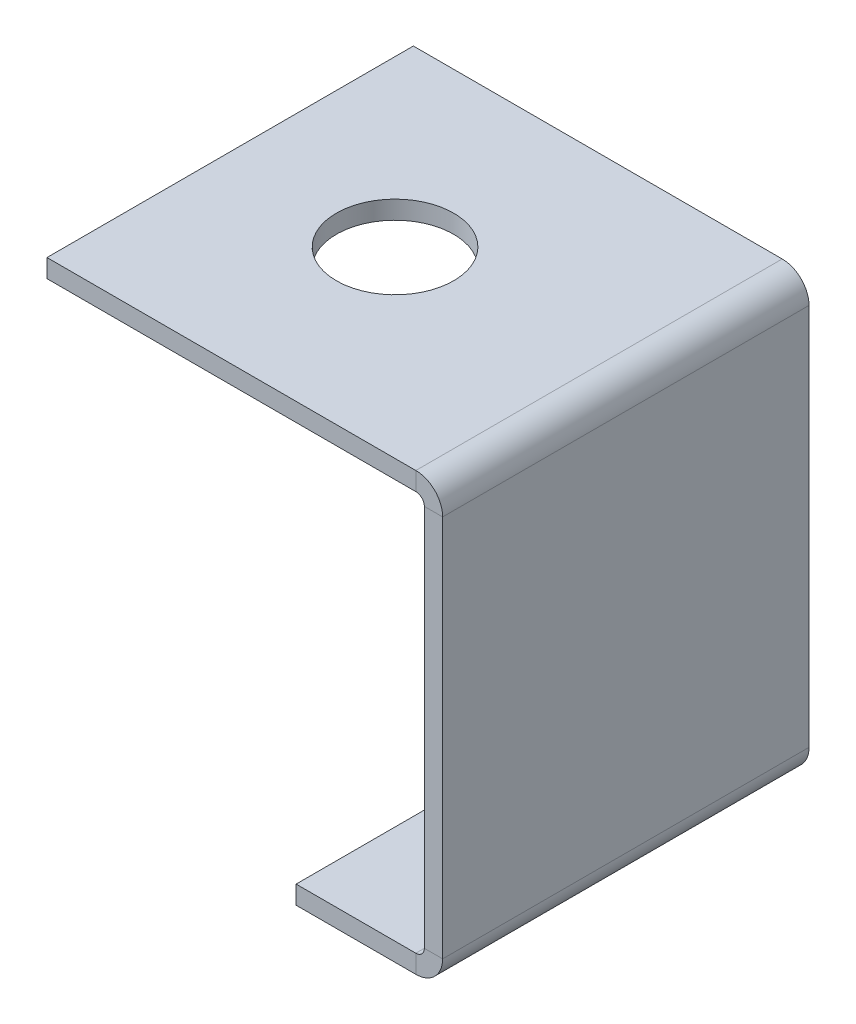
ISO-10303-21;
HEADER;
FILE_DESCRIPTION(('STEP AP214'),'2;1');
FILE_NAME('part.step','',(''),(''),'','','');
FILE_SCHEMA(('AUTOMOTIVE_DESIGN { 1 0 10303 214 1 1 1 1 }'));
ENDSEC;
DATA;
#1=APPLICATION_CONTEXT('core data for automotive mechanical design processes');
#2=APPLICATION_PROTOCOL_DEFINITION('international standard','automotive_design',2000,#1);
#3=PRODUCT_CONTEXT('',#1,'mechanical');
#4=PRODUCT('Part','Part','',(#3));
#5=PRODUCT_RELATED_PRODUCT_CATEGORY('part','',(#4));
#6=PRODUCT_DEFINITION_FORMATION('','',#4);
#7=PRODUCT_DEFINITION_CONTEXT('part definition',#1,'design');
#8=PRODUCT_DEFINITION('design','',#6,#7);
#9=PRODUCT_DEFINITION_SHAPE('','',#8);
#10=(LENGTH_UNIT() NAMED_UNIT(*) SI_UNIT(.MILLI.,.METRE.));
#11=(NAMED_UNIT(*) PLANE_ANGLE_UNIT() SI_UNIT($,.RADIAN.));
#12=(NAMED_UNIT(*) SI_UNIT($,.STERADIAN.) SOLID_ANGLE_UNIT());
#13=UNCERTAINTY_MEASURE_WITH_UNIT(LENGTH_MEASURE(1.E-05),#10,'distance_accuracy_value','');
#14=(GEOMETRIC_REPRESENTATION_CONTEXT(3) GLOBAL_UNCERTAINTY_ASSIGNED_CONTEXT((#13)) GLOBAL_UNIT_ASSIGNED_CONTEXT((#10,
#11,#12)) REPRESENTATION_CONTEXT('',''));
#15=CARTESIAN_POINT('',(0.,0.,0.));
#16=DIRECTION('',(0.,0.,1.));
#17=DIRECTION('',(1.,0.,0.));
#18=AXIS2_PLACEMENT_3D('',#15,#16,#17);
#19=CARTESIAN_POINT('',(34.2900000000001,-37.81552,31.75));
#20=DIRECTION('',(0.,0.,-1.));
#21=DIRECTION('',(0.,1.,0.));
#22=AXIS2_PLACEMENT_3D('',#19,#20,#21);
#23=PLANE('',#22);
#24=DIRECTION('',(1.,0.,0.));
#25=VECTOR('',#24,1.);
#26=CARTESIAN_POINT('',(32.7025000000001,-35.49142,31.75));
#27=LINE('',#26,#25);
#28=CARTESIAN_POINT('',(32.7025000000001,-35.49142,31.75));
#29=VERTEX_POINT('',#28);
#30=CARTESIAN_POINT('',(34.2900000000001,-35.49142,31.75));
#31=VERTEX_POINT('',#30);
#32=EDGE_CURVE('E199',#29,#31,#27,.T.);
#33=ORIENTED_EDGE('',*,*,#32,.T.);
#34=DIRECTION('',(0.,-1.,0.));
#35=VECTOR('',#34,1.);
#36=CARTESIAN_POINT('',(34.2900000000001,-37.81552,31.75));
#37=LINE('',#36,#35);
#38=CARTESIAN_POINT('',(34.29,-2.32409999999999,31.75));
#39=VERTEX_POINT('',#38);
#40=EDGE_CURVE('E225',#39,#31,#37,.T.);
#41=ORIENTED_EDGE('',*,*,#40,.F.);
#42=DIRECTION('',(1.,0.,0.));
#43=VECTOR('',#42,1.);
#44=CARTESIAN_POINT('',(32.7025,-2.3241,31.75));
#45=LINE('',#44,#43);
#46=CARTESIAN_POINT('',(32.7025,-2.3241,31.75));
#47=VERTEX_POINT('',#46);
#48=EDGE_CURVE('E217',#47,#39,#45,.T.);
#49=ORIENTED_EDGE('',*,*,#48,.F.);
#50=DIRECTION('',(0.,-1.,0.));
#51=VECTOR('',#50,1.);
#52=CARTESIAN_POINT('',(32.7025000000001,-37.81552,31.75));
#53=LINE('',#52,#51);
#54=EDGE_CURVE('E224',#47,#29,#53,.T.);
#55=ORIENTED_EDGE('',*,*,#54,.T.);
#56=EDGE_LOOP('',(#33,#41,#49,#55));
#57=FACE_BOUND('',#56,.T.);
#58=ADVANCED_FACE('F59',(#57),#23,.F.);
#59=CARTESIAN_POINT('',(34.29,-1.58749999999999,0.));
#60=DIRECTION('',(0.,0.,1.));
#61=DIRECTION('',(0.,-1.,0.));
#62=AXIS2_PLACEMENT_3D('',#59,#60,#61);
#63=PLANE('',#62);
#64=DIRECTION('',(1.,0.,0.));
#65=VECTOR('',#64,1.);
#66=CARTESIAN_POINT('',(32.7025000000001,-35.49142,0.));
#67=LINE('',#66,#65);
#68=CARTESIAN_POINT('',(32.7025000000001,-35.49142,0.));
#69=VERTEX_POINT('',#68);
#70=CARTESIAN_POINT('',(34.2900000000001,-35.49142,0.));
#71=VERTEX_POINT('',#70);
#72=EDGE_CURVE('E209',#69,#71,#67,.T.);
#73=ORIENTED_EDGE('',*,*,#72,.F.);
#74=DIRECTION('',(0.,1.,0.));
#75=VECTOR('',#74,1.);
#76=CARTESIAN_POINT('',(32.7025,-1.5875,0.));
#77=LINE('',#76,#75);
#78=CARTESIAN_POINT('',(32.7025,-2.3241,0.));
#79=VERTEX_POINT('',#78);
#80=EDGE_CURVE('E228',#69,#79,#77,.T.);
#81=ORIENTED_EDGE('',*,*,#80,.T.);
#82=DIRECTION('',(1.,0.,0.));
#83=VECTOR('',#82,1.);
#84=CARTESIAN_POINT('',(32.7025,-2.3241,0.));
#85=LINE('',#84,#83);
#86=CARTESIAN_POINT('',(34.29,-2.32409999999999,0.));
#87=VERTEX_POINT('',#86);
#88=EDGE_CURVE('E212',#79,#87,#85,.T.);
#89=ORIENTED_EDGE('',*,*,#88,.T.);
#90=DIRECTION('',(0.,1.,0.));
#91=VECTOR('',#90,1.);
#92=CARTESIAN_POINT('',(34.29,-1.58749999999999,0.));
#93=LINE('',#92,#91);
#94=EDGE_CURVE('E227',#71,#87,#93,.T.);
#95=ORIENTED_EDGE('',*,*,#94,.F.);
#96=EDGE_LOOP('',(#73,#81,#89,#95));
#97=FACE_BOUND('',#96,.T.);
#98=ADVANCED_FACE('F311',(#97),#63,.F.);
#99=CARTESIAN_POINT('',(34.29,1.18288198281482E-13,0.));
#100=DIRECTION('',(-1.,0.,0.));
#101=DIRECTION('',(0.,-1.,0.));
#102=AXIS2_PLACEMENT_3D('',#99,#100,#101);
#103=PLANE('',#102);
#104=DIRECTION('',(0.,0.,1.));
#105=VECTOR('',#104,1.);
#106=CARTESIAN_POINT('',(34.2900000000001,-35.49142,31.75));
#107=LINE('',#106,#105);
#108=EDGE_CURVE('E193',#31,#71,#107,.F.);
#109=ORIENTED_EDGE('',*,*,#108,.T.);
#110=ORIENTED_EDGE('',*,*,#94,.T.);
#111=DIRECTION('',(0.,0.,-1.));
#112=VECTOR('',#111,1.);
#113=CARTESIAN_POINT('',(34.29,-2.32409999999999,0.));
#114=LINE('',#113,#112);
#115=EDGE_CURVE('E220',#39,#87,#114,.T.);
#116=ORIENTED_EDGE('',*,*,#115,.F.);
#117=ORIENTED_EDGE('',*,*,#40,.T.);
#118=EDGE_LOOP('',(#109,#110,#116,#117));
#119=FACE_BOUND('',#118,.T.);
#120=ADVANCED_FACE('F317',(#119),#103,.F.);
#121=CARTESIAN_POINT('',(32.7025,1.12745471656068E-13,0.));
#122=DIRECTION('',(-1.,0.,0.));
#123=DIRECTION('',(0.,-1.,0.));
#124=AXIS2_PLACEMENT_3D('',#121,#122,#123);
#125=PLANE('',#124);
#126=ORIENTED_EDGE('',*,*,#80,.F.);
#127=DIRECTION('',(0.,0.,1.));
#128=VECTOR('',#127,1.);
#129=CARTESIAN_POINT('',(32.7025000000001,-35.49142,31.75));
#130=LINE('',#129,#128);
#131=EDGE_CURVE('E74',#29,#69,#130,.F.);
#132=ORIENTED_EDGE('',*,*,#131,.F.);
#133=ORIENTED_EDGE('',*,*,#54,.F.);
#134=DIRECTION('',(0.,0.,1.));
#135=VECTOR('',#134,1.);
#136=CARTESIAN_POINT('',(32.7025,-2.3241,0.));
#137=LINE('',#136,#135);
#138=EDGE_CURVE('E215',#79,#47,#137,.T.);
#139=ORIENTED_EDGE('',*,*,#138,.F.);
#140=EDGE_LOOP('',(#126,#132,#133,#139));
#141=FACE_BOUND('',#140,.T.);
#142=ADVANCED_FACE('F308',(#141),#125,.T.);
#143=CARTESIAN_POINT('',(0.,-1.5875,31.75));
#144=DIRECTION('',(0.,0.,1.));
#145=DIRECTION('',(1.,0.,0.));
#146=AXIS2_PLACEMENT_3D('',#143,#144,#145);
#147=PLANE('',#146);
#148=DIRECTION('',(1.,0.,0.));
#149=VECTOR('',#148,1.);
#150=CARTESIAN_POINT('',(0.,-1.5875,31.75));
#151=LINE('',#150,#149);
#152=CARTESIAN_POINT('',(0.,-1.5875,31.75));
#153=VERTEX_POINT('',#152);
#154=CARTESIAN_POINT('',(31.9659,-1.58750000000001,31.75));
#155=VERTEX_POINT('',#154);
#156=EDGE_CURVE('E262',#153,#155,#151,.T.);
#157=ORIENTED_EDGE('',*,*,#156,.T.);
#158=DIRECTION('',(0.,1.,0.));
#159=VECTOR('',#158,1.);
#160=CARTESIAN_POINT('',(31.9659,-1.58750000000001,31.75));
#161=LINE('',#160,#159);
#162=CARTESIAN_POINT('',(31.9659,0.,31.75));
#163=VERTEX_POINT('',#162);
#164=EDGE_CURVE('E238',#155,#163,#161,.T.);
#165=ORIENTED_EDGE('',*,*,#164,.T.);
#166=DIRECTION('',(1.,0.,0.));
#167=VECTOR('',#166,1.);
#168=CARTESIAN_POINT('',(0.,0.,31.75));
#169=LINE('',#168,#167);
#170=CARTESIAN_POINT('',(0.,0.,31.75));
#171=VERTEX_POINT('',#170);
#172=EDGE_CURVE('E270',#171,#163,#169,.T.);
#173=ORIENTED_EDGE('',*,*,#172,.F.);
#174=DIRECTION('',(0.,1.,0.));
#175=VECTOR('',#174,1.);
#176=CARTESIAN_POINT('',(0.,-1.5875,31.75));
#177=LINE('',#176,#175);
#178=EDGE_CURVE('E63',#153,#171,#177,.T.);
#179=ORIENTED_EDGE('',*,*,#178,.F.);
#180=EDGE_LOOP('',(#157,#165,#173,#179));
#181=FACE_BOUND('',#180,.T.);
#182=ADVANCED_FACE('F287',(#181),#147,.T.);
#183=CARTESIAN_POINT('',(0.,-1.5875,0.));
#184=DIRECTION('',(0.,1.,0.));
#185=DIRECTION('',(0.,0.,1.));
#186=AXIS2_PLACEMENT_3D('',#183,#184,#185);
#187=PLANE('',#186);
#188=CARTESIAN_POINT('',(14.2875,-1.5875,15.875));
#189=DIRECTION('',(0.,1.,0.));
#190=DIRECTION('',(0.,0.,1.));
#191=AXIS2_PLACEMENT_3D('',#188,#189,#190);
#192=CIRCLE('',#191,5.08);
#193=CARTESIAN_POINT('',(14.2875,-1.5875,20.955));
#194=VERTEX_POINT('',#193);
#195=EDGE_CURVE('E253',#194,#194,#192,.T.);
#196=ORIENTED_EDGE('',*,*,#195,.T.);
#197=EDGE_LOOP('',(#196));
#198=FACE_BOUND('',#197,.T.);
#199=DIRECTION('',(0.,0.,1.));
#200=VECTOR('',#199,1.);
#201=CARTESIAN_POINT('',(31.9659,-1.58750000000001,31.75));
#202=LINE('',#201,#200);
#203=CARTESIAN_POINT('',(31.9659,-1.58750000000001,0.));
#204=VERTEX_POINT('',#203);
#205=EDGE_CURVE('E244',#155,#204,#202,.F.);
#206=ORIENTED_EDGE('',*,*,#205,.F.);
#207=ORIENTED_EDGE('',*,*,#156,.F.);
#208=DIRECTION('',(0.,0.,1.));
#209=VECTOR('',#208,1.);
#210=CARTESIAN_POINT('',(0.,-1.5875,0.));
#211=LINE('',#210,#209);
#212=CARTESIAN_POINT('',(0.,-1.5875,0.));
#213=VERTEX_POINT('',#212);
#214=EDGE_CURVE('E259',#213,#153,#211,.T.);
#215=ORIENTED_EDGE('',*,*,#214,.F.);
#216=DIRECTION('',(-1.,0.,0.));
#217=VECTOR('',#216,1.);
#218=CARTESIAN_POINT('',(0.,-1.5875,0.));
#219=LINE('',#218,#217);
#220=EDGE_CURVE('E266',#204,#213,#219,.T.);
#221=ORIENTED_EDGE('',*,*,#220,.F.);
#222=EDGE_LOOP('',(#206,#207,#215,#221));
#223=FACE_BOUND('',#222,.T.);
#224=ADVANCED_FACE('F298',(#198,#223),#187,.F.);
#225=CARTESIAN_POINT('',(0.,0.,0.));
#226=DIRECTION('',(0.,1.,0.));
#227=DIRECTION('',(0.,0.,1.));
#228=AXIS2_PLACEMENT_3D('',#225,#226,#227);
#229=PLANE('',#228);
#230=CARTESIAN_POINT('',(14.2875,0.,15.875));
#231=DIRECTION('',(0.,1.,0.));
#232=DIRECTION('',(0.,0.,1.));
#233=AXIS2_PLACEMENT_3D('',#230,#231,#232);
#234=CIRCLE('',#233,5.08);
#235=CARTESIAN_POINT('',(14.2875,0.,20.955));
#236=VERTEX_POINT('',#235);
#237=EDGE_CURVE('E250',#236,#236,#234,.T.);
#238=ORIENTED_EDGE('',*,*,#237,.F.);
#239=EDGE_LOOP('',(#238));
#240=FACE_BOUND('',#239,.T.);
#241=ORIENTED_EDGE('',*,*,#172,.T.);
#242=DIRECTION('',(0.,0.,1.));
#243=VECTOR('',#242,1.);
#244=CARTESIAN_POINT('',(31.9659,0.,31.75));
#245=LINE('',#244,#243);
#246=CARTESIAN_POINT('',(31.9659,0.,0.));
#247=VERTEX_POINT('',#246);
#248=EDGE_CURVE('E233',#163,#247,#245,.F.);
#249=ORIENTED_EDGE('',*,*,#248,.T.);
#250=DIRECTION('',(-1.,0.,0.));
#251=VECTOR('',#250,1.);
#252=CARTESIAN_POINT('',(0.,0.,0.));
#253=LINE('',#252,#251);
#254=CARTESIAN_POINT('',(0.,0.,0.));
#255=VERTEX_POINT('',#254);
#256=EDGE_CURVE('E263',#247,#255,#253,.T.);
#257=ORIENTED_EDGE('',*,*,#256,.T.);
#258=DIRECTION('',(0.,0.,1.));
#259=VECTOR('',#258,1.);
#260=CARTESIAN_POINT('',(0.,0.,0.));
#261=LINE('',#260,#259);
#262=EDGE_CURVE('E256',#255,#171,#261,.T.);
#263=ORIENTED_EDGE('',*,*,#262,.T.);
#264=EDGE_LOOP('',(#241,#249,#257,#263));
#265=FACE_BOUND('',#264,.T.);
#266=ADVANCED_FACE('F275',(#240,#265),#229,.T.);
#267=CARTESIAN_POINT('',(0.,-1.5875,0.));
#268=DIRECTION('',(-1.,0.,0.));
#269=DIRECTION('',(0.,0.,1.));
#270=AXIS2_PLACEMENT_3D('',#267,#268,#269);
#271=PLANE('',#270);
#272=ORIENTED_EDGE('',*,*,#262,.F.);
#273=DIRECTION('',(0.,1.,0.));
#274=VECTOR('',#273,1.);
#275=CARTESIAN_POINT('',(0.,-1.5875,0.));
#276=LINE('',#275,#274);
#277=EDGE_CURVE('E13',#213,#255,#276,.T.);
#278=ORIENTED_EDGE('',*,*,#277,.F.);
#279=ORIENTED_EDGE('',*,*,#214,.T.);
#280=ORIENTED_EDGE('',*,*,#178,.T.);
#281=EDGE_LOOP('',(#272,#278,#279,#280));
#282=FACE_BOUND('',#281,.T.);
#283=ADVANCED_FACE('F61',(#282),#271,.T.);
#284=CARTESIAN_POINT('',(0.,-1.5875,0.));
#285=DIRECTION('',(0.,0.,-1.));
#286=DIRECTION('',(-1.,0.,0.));
#287=AXIS2_PLACEMENT_3D('',#284,#285,#286);
#288=PLANE('',#287);
#289=DIRECTION('',(0.,1.,0.));
#290=VECTOR('',#289,1.);
#291=CARTESIAN_POINT('',(31.9659,-1.58750000000001,0.));
#292=LINE('',#291,#290);
#293=EDGE_CURVE('E248',#204,#247,#292,.T.);
#294=ORIENTED_EDGE('',*,*,#293,.F.);
#295=ORIENTED_EDGE('',*,*,#220,.T.);
#296=ORIENTED_EDGE('',*,*,#277,.T.);
#297=ORIENTED_EDGE('',*,*,#256,.F.);
#298=EDGE_LOOP('',(#294,#295,#296,#297));
#299=FACE_BOUND('',#298,.T.);
#300=ADVANCED_FACE('F280',(#299),#288,.T.);
#301=CARTESIAN_POINT('',(14.2875,-1.5875,15.875));
#302=DIRECTION('',(0.,1.,0.));
#303=DIRECTION('',(0.,0.,1.));
#304=AXIS2_PLACEMENT_3D('',#301,#302,#303);
#305=CYLINDRICAL_SURFACE('',#304,5.08);
#306=ORIENTED_EDGE('',*,*,#195,.F.);
#307=EDGE_LOOP('',(#306));
#308=FACE_BOUND('',#307,.T.);
#309=ORIENTED_EDGE('',*,*,#237,.T.);
#310=EDGE_LOOP('',(#309));
#311=FACE_BOUND('',#310,.T.);
#312=ADVANCED_FACE('F331',(#308,#311),#305,.F.);
#313=CARTESIAN_POINT('',(31.9659,-2.3241,0.));
#314=DIRECTION('',(0.,0.,-1.));
#315=DIRECTION('',(-1.,0.,0.));
#316=AXIS2_PLACEMENT_3D('',#313,#314,#315);
#317=PLANE('',#316);
#318=ORIENTED_EDGE('',*,*,#88,.F.);
#319=CARTESIAN_POINT('',(31.9659,-2.3241,0.));
#320=DIRECTION('',(0.,0.,1.));
#321=DIRECTION('',(1.,0.,0.));
#322=AXIS2_PLACEMENT_3D('',#319,#320,#321);
#323=CIRCLE('',#322,0.73659999999999);
#324=EDGE_CURVE('E241',#204,#79,#323,.F.);
#325=ORIENTED_EDGE('',*,*,#324,.F.);
#326=ORIENTED_EDGE('',*,*,#293,.T.);
#327=CARTESIAN_POINT('',(31.9659,-2.3241,0.));
#328=DIRECTION('',(0.,0.,1.));
#329=DIRECTION('',(1.,0.,0.));
#330=AXIS2_PLACEMENT_3D('',#327,#328,#329);
#331=CIRCLE('',#330,2.32409999999999);
#332=EDGE_CURVE('E82',#247,#87,#331,.F.);
#333=ORIENTED_EDGE('',*,*,#332,.T.);
#334=EDGE_LOOP('',(#318,#325,#326,#333));
#335=FACE_BOUND('',#334,.T.);
#336=ADVANCED_FACE('F328',(#335),#317,.T.);
#337=CARTESIAN_POINT('',(31.9659,-2.3241,31.75));
#338=DIRECTION('',(0.,0.,-1.));
#339=DIRECTION('',(-1.,0.,0.));
#340=AXIS2_PLACEMENT_3D('',#337,#338,#339);
#341=PLANE('',#340);
#342=CARTESIAN_POINT('',(31.9659,-2.3241,31.75));
#343=DIRECTION('',(0.,0.,1.));
#344=DIRECTION('',(1.,0.,0.));
#345=AXIS2_PLACEMENT_3D('',#342,#343,#344);
#346=CIRCLE('',#345,0.73659999999999);
#347=EDGE_CURVE('E230',#47,#155,#346,.T.);
#348=ORIENTED_EDGE('',*,*,#347,.F.);
#349=ORIENTED_EDGE('',*,*,#48,.T.);
#350=CARTESIAN_POINT('',(31.9659,-2.3241,31.75));
#351=DIRECTION('',(0.,0.,1.));
#352=DIRECTION('',(1.,0.,0.));
#353=AXIS2_PLACEMENT_3D('',#350,#351,#352);
#354=CIRCLE('',#353,2.32409999999999);
#355=EDGE_CURVE('E236',#39,#163,#354,.T.);
#356=ORIENTED_EDGE('',*,*,#355,.T.);
#357=ORIENTED_EDGE('',*,*,#164,.F.);
#358=EDGE_LOOP('',(#348,#349,#356,#357));
#359=FACE_BOUND('',#358,.T.);
#360=ADVANCED_FACE('F290',(#359),#341,.F.);
#361=CARTESIAN_POINT('',(31.9659,-2.3241,31.75));
#362=DIRECTION('',(0.,0.,1.));
#363=DIRECTION('',(1.,0.,0.));
#364=AXIS2_PLACEMENT_3D('',#361,#362,#363);
#365=CYLINDRICAL_SURFACE('',#364,2.32409999999999);
#366=ORIENTED_EDGE('',*,*,#248,.F.);
#367=ORIENTED_EDGE('',*,*,#355,.F.);
#368=ORIENTED_EDGE('',*,*,#115,.T.);
#369=ORIENTED_EDGE('',*,*,#332,.F.);
#370=EDGE_LOOP('',(#366,#367,#368,#369));
#371=FACE_BOUND('',#370,.T.);
#372=ADVANCED_FACE('F322',(#371),#365,.T.);
#373=CARTESIAN_POINT('',(31.9659,-2.3241,31.75));
#374=DIRECTION('',(0.,0.,1.));
#375=DIRECTION('',(1.,0.,0.));
#376=AXIS2_PLACEMENT_3D('',#373,#374,#375);
#377=CYLINDRICAL_SURFACE('',#376,0.73659999999999);
#378=ORIENTED_EDGE('',*,*,#205,.T.);
#379=ORIENTED_EDGE('',*,*,#324,.T.);
#380=ORIENTED_EDGE('',*,*,#138,.T.);
#381=ORIENTED_EDGE('',*,*,#347,.T.);
#382=EDGE_LOOP('',(#378,#379,#380,#381));
#383=FACE_BOUND('',#382,.T.);
#384=ADVANCED_FACE('F294',(#383),#377,.F.);
#385=CARTESIAN_POINT('',(31.9659000000001,-35.49142,0.));
#386=DIRECTION('',(0.,0.,-1.));
#387=DIRECTION('',(-1.,0.,0.));
#388=AXIS2_PLACEMENT_3D('',#385,#386,#387);
#389=PLANE('',#388);
#390=DIRECTION('',(0.,1.,0.));
#391=VECTOR('',#390,1.);
#392=CARTESIAN_POINT('',(31.9659000000001,-37.81552,0.));
#393=LINE('',#392,#391);
#394=CARTESIAN_POINT('',(31.9659000000001,-36.22802,0.));
#395=VERTEX_POINT('',#394);
#396=CARTESIAN_POINT('',(31.9659000000001,-37.81552,0.));
#397=VERTEX_POINT('',#396);
#398=EDGE_CURVE('E175',#395,#397,#393,.F.);
#399=ORIENTED_EDGE('',*,*,#398,.F.);
#400=CARTESIAN_POINT('',(31.9659000000001,-35.49142,0.));
#401=DIRECTION('',(0.,0.,1.));
#402=DIRECTION('',(1.,0.,0.));
#403=AXIS2_PLACEMENT_3D('',#400,#401,#402);
#404=CIRCLE('',#403,0.736600000000004);
#405=EDGE_CURVE('E202',#69,#395,#404,.F.);
#406=ORIENTED_EDGE('',*,*,#405,.F.);
#407=ORIENTED_EDGE('',*,*,#72,.T.);
#408=CARTESIAN_POINT('',(31.9659000000001,-35.49142,0.));
#409=DIRECTION('',(0.,0.,1.));
#410=DIRECTION('',(1.,0.,0.));
#411=AXIS2_PLACEMENT_3D('',#408,#409,#410);
#412=CIRCLE('',#411,2.3241);
#413=EDGE_CURVE('E195',#71,#397,#412,.F.);
#414=ORIENTED_EDGE('',*,*,#413,.T.);
#415=EDGE_LOOP('',(#399,#406,#407,#414));
#416=FACE_BOUND('',#415,.T.);
#417=ADVANCED_FACE('F327',(#416),#389,.T.);
#418=CARTESIAN_POINT('',(31.9659000000001,-35.49142,31.75));
#419=DIRECTION('',(0.,0.,-1.));
#420=DIRECTION('',(-1.,0.,0.));
#421=AXIS2_PLACEMENT_3D('',#418,#419,#420);
#422=PLANE('',#421);
#423=CARTESIAN_POINT('',(31.9659000000001,-35.49142,31.75));
#424=DIRECTION('',(0.,0.,1.));
#425=DIRECTION('',(1.,0.,0.));
#426=AXIS2_PLACEMENT_3D('',#423,#424,#425);
#427=CIRCLE('',#426,0.736600000000004);
#428=CARTESIAN_POINT('',(31.9659000000001,-36.22802,31.75));
#429=VERTEX_POINT('',#428);
#430=EDGE_CURVE('E206',#429,#29,#427,.T.);
#431=ORIENTED_EDGE('',*,*,#430,.F.);
#432=DIRECTION('',(0.,1.,0.));
#433=VECTOR('',#432,1.);
#434=CARTESIAN_POINT('',(31.9659000000001,-36.22802,31.75));
#435=LINE('',#434,#433);
#436=CARTESIAN_POINT('',(31.9659000000001,-37.81552,31.75));
#437=VERTEX_POINT('',#436);
#438=EDGE_CURVE('E187',#429,#437,#435,.F.);
#439=ORIENTED_EDGE('',*,*,#438,.T.);
#440=CARTESIAN_POINT('',(31.9659000000001,-35.49142,31.75));
#441=DIRECTION('',(0.,0.,1.));
#442=DIRECTION('',(1.,0.,0.));
#443=AXIS2_PLACEMENT_3D('',#440,#441,#442);
#444=CIRCLE('',#443,2.3241);
#445=EDGE_CURVE('E196',#437,#31,#444,.T.);
#446=ORIENTED_EDGE('',*,*,#445,.T.);
#447=ORIENTED_EDGE('',*,*,#32,.F.);
#448=EDGE_LOOP('',(#431,#439,#446,#447));
#449=FACE_BOUND('',#448,.T.);
#450=ADVANCED_FACE('F427',(#449),#422,.F.);
#451=CARTESIAN_POINT('',(31.9659000000001,-35.49142,31.75));
#452=DIRECTION('',(0.,0.,1.));
#453=DIRECTION('',(0.,-1.,0.));
#454=AXIS2_PLACEMENT_3D('',#451,#452,#453);
#455=CYLINDRICAL_SURFACE('',#454,2.3241);
#456=ORIENTED_EDGE('',*,*,#108,.F.);
#457=ORIENTED_EDGE('',*,*,#445,.F.);
#458=DIRECTION('',(0.,0.,1.));
#459=VECTOR('',#458,1.);
#460=CARTESIAN_POINT('',(31.9659000000001,-37.81552,0.));
#461=LINE('',#460,#459);
#462=EDGE_CURVE('E185',#437,#397,#461,.F.);
#463=ORIENTED_EDGE('',*,*,#462,.T.);
#464=ORIENTED_EDGE('',*,*,#413,.F.);
#465=EDGE_LOOP('',(#456,#457,#463,#464));
#466=FACE_BOUND('',#465,.T.);
#467=ADVANCED_FACE('F437',(#466),#455,.T.);
#468=CARTESIAN_POINT('',(31.9659000000001,-35.49142,31.75));
#469=DIRECTION('',(0.,0.,1.));
#470=DIRECTION('',(0.,-1.,0.));
#471=AXIS2_PLACEMENT_3D('',#468,#469,#470);
#472=CYLINDRICAL_SURFACE('',#471,0.736600000000004);
#473=ORIENTED_EDGE('',*,*,#131,.T.);
#474=ORIENTED_EDGE('',*,*,#405,.T.);
#475=DIRECTION('',(0.,0.,1.));
#476=VECTOR('',#475,1.);
#477=CARTESIAN_POINT('',(31.9659000000001,-36.22802,0.));
#478=LINE('',#477,#476);
#479=EDGE_CURVE('E190',#395,#429,#478,.T.);
#480=ORIENTED_EDGE('',*,*,#479,.T.);
#481=ORIENTED_EDGE('',*,*,#430,.T.);
#482=EDGE_LOOP('',(#473,#474,#480,#481));
#483=FACE_BOUND('',#482,.T.);
#484=ADVANCED_FACE('F448',(#483),#472,.F.);
#485=CARTESIAN_POINT('',(21.5900000000001,-37.8155200000001,31.75));
#486=DIRECTION('',(0.,0.,-1.));
#487=DIRECTION('',(0.,1.,0.));
#488=AXIS2_PLACEMENT_3D('',#485,#486,#487);
#489=PLANE('',#488);
#490=ORIENTED_EDGE('',*,*,#438,.F.);
#491=DIRECTION('',(1.,0.,0.));
#492=VECTOR('',#491,1.);
#493=CARTESIAN_POINT('',(21.5900000000001,-36.2280200000001,31.75));
#494=LINE('',#493,#492);
#495=CARTESIAN_POINT('',(21.5900000000001,-36.2280200000001,31.75));
#496=VERTEX_POINT('',#495);
#497=EDGE_CURVE('E183',#429,#496,#494,.F.);
#498=ORIENTED_EDGE('',*,*,#497,.T.);
#499=DIRECTION('',(0.,1.,0.));
#500=VECTOR('',#499,1.);
#501=CARTESIAN_POINT('',(21.5900000000001,-37.8155200000001,31.75));
#502=LINE('',#501,#500);
#503=CARTESIAN_POINT('',(21.5900000000001,-37.8155200000001,31.75));
#504=VERTEX_POINT('',#503);
#505=EDGE_CURVE('E171',#504,#496,#502,.T.);
#506=ORIENTED_EDGE('',*,*,#505,.F.);
#507=DIRECTION('',(-1.,0.,0.));
#508=VECTOR('',#507,1.);
#509=CARTESIAN_POINT('',(2.65284161335147E-13,-37.8155200000002,31.75));
#510=LINE('',#509,#508);
#511=EDGE_CURVE('E158',#437,#504,#510,.T.);
#512=ORIENTED_EDGE('',*,*,#511,.F.);
#513=EDGE_LOOP('',(#490,#498,#506,#512));
#514=FACE_BOUND('',#513,.T.);
#515=ADVANCED_FACE('F459',(#514),#489,.F.);
#516=CARTESIAN_POINT('',(32.7025000000001,-37.81552,0.));
#517=DIRECTION('',(0.,0.,1.));
#518=DIRECTION('',(1.,0.,0.));
#519=AXIS2_PLACEMENT_3D('',#516,#517,#518);
#520=PLANE('',#519);
#521=ORIENTED_EDGE('',*,*,#398,.T.);
#522=DIRECTION('',(1.,0.,0.));
#523=VECTOR('',#522,1.);
#524=CARTESIAN_POINT('',(2.65284161335147E-13,-37.8155200000002,0.));
#525=LINE('',#524,#523);
#526=CARTESIAN_POINT('',(21.5900000000001,-37.8155200000001,0.));
#527=VERTEX_POINT('',#526);
#528=EDGE_CURVE('E156',#527,#397,#525,.T.);
#529=ORIENTED_EDGE('',*,*,#528,.F.);
#530=DIRECTION('',(0.,1.,0.));
#531=VECTOR('',#530,1.);
#532=CARTESIAN_POINT('',(21.5900000000001,-37.8155200000001,0.));
#533=LINE('',#532,#531);
#534=CARTESIAN_POINT('',(21.5900000000001,-36.2280200000001,0.));
#535=VERTEX_POINT('',#534);
#536=EDGE_CURVE('E164',#527,#535,#533,.T.);
#537=ORIENTED_EDGE('',*,*,#536,.T.);
#538=DIRECTION('',(-1.,0.,0.));
#539=VECTOR('',#538,1.);
#540=CARTESIAN_POINT('',(32.7025000000001,-36.22802,0.));
#541=LINE('',#540,#539);
#542=EDGE_CURVE('E180',#535,#395,#541,.F.);
#543=ORIENTED_EDGE('',*,*,#542,.T.);
#544=EDGE_LOOP('',(#521,#529,#537,#543));
#545=FACE_BOUND('',#544,.T.);
#546=ADVANCED_FACE('F174',(#545),#520,.F.);
#547=CARTESIAN_POINT('',(2.65284161335147E-13,-37.8155200000002,0.));
#548=DIRECTION('',(0.,1.,0.));
#549=DIRECTION('',(-1.,0.,0.));
#550=AXIS2_PLACEMENT_3D('',#547,#548,#549);
#551=PLANE('',#550);
#552=ORIENTED_EDGE('',*,*,#462,.F.);
#553=ORIENTED_EDGE('',*,*,#511,.T.);
#554=DIRECTION('',(0.,0.,-1.));
#555=VECTOR('',#554,1.);
#556=CARTESIAN_POINT('',(21.5900000000001,-37.8155200000001,0.));
#557=LINE('',#556,#555);
#558=EDGE_CURVE('E151',#504,#527,#557,.T.);
#559=ORIENTED_EDGE('',*,*,#558,.T.);
#560=ORIENTED_EDGE('',*,*,#528,.T.);
#561=EDGE_LOOP('',(#552,#553,#559,#560));
#562=FACE_BOUND('',#561,.T.);
#563=ADVANCED_FACE('F154',(#562),#551,.F.);
#564=CARTESIAN_POINT('',(2.54268353561381E-13,-36.2280200000002,0.));
#565=DIRECTION('',(0.,1.,0.));
#566=DIRECTION('',(-1.,0.,0.));
#567=AXIS2_PLACEMENT_3D('',#564,#565,#566);
#568=PLANE('',#567);
#569=ORIENTED_EDGE('',*,*,#497,.F.);
#570=ORIENTED_EDGE('',*,*,#479,.F.);
#571=ORIENTED_EDGE('',*,*,#542,.F.);
#572=DIRECTION('',(0.,0.,1.));
#573=VECTOR('',#572,1.);
#574=CARTESIAN_POINT('',(21.5900000000001,-36.2280200000001,0.));
#575=LINE('',#574,#573);
#576=EDGE_CURVE('E167',#496,#535,#575,.F.);
#577=ORIENTED_EDGE('',*,*,#576,.F.);
#578=EDGE_LOOP('',(#569,#570,#571,#577));
#579=FACE_BOUND('',#578,.T.);
#580=ADVANCED_FACE('F489',(#579),#568,.T.);
#581=CARTESIAN_POINT('',(21.5900000000001,-37.8155200000001,0.));
#582=DIRECTION('',(1.,0.,0.));
#583=DIRECTION('',(0.,1.,0.));
#584=AXIS2_PLACEMENT_3D('',#581,#582,#583);
#585=PLANE('',#584);
#586=ORIENTED_EDGE('',*,*,#576,.T.);
#587=ORIENTED_EDGE('',*,*,#536,.F.);
#588=ORIENTED_EDGE('',*,*,#558,.F.);
#589=ORIENTED_EDGE('',*,*,#505,.T.);
#590=EDGE_LOOP('',(#586,#587,#588,#589));
#591=FACE_BOUND('',#590,.T.);
#592=ADVANCED_FACE('F165',(#591),#585,.F.);
#593=CLOSED_SHELL('',(#58,#98,#120,#142,#182,#224,#266,#283,#300,#312,#336,#360,#372,#384,#417,
#450,#467,#484,#515,#546,#563,#580,#592));
#594=MANIFOLD_SOLID_BREP('B2',#593);
#595=ADVANCED_BREP_SHAPE_REPRESENTATION('',(#18,#594),#14);
#596=SHAPE_DEFINITION_REPRESENTATION(#9,#595);
ENDSEC;
END-ISO-10303-21;
